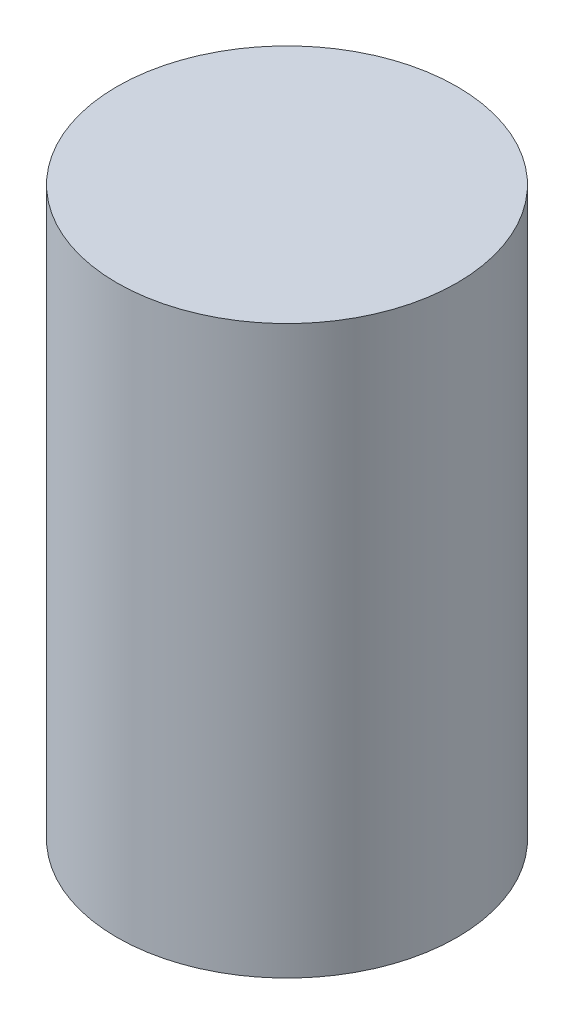
ISO-10303-21;
HEADER;
FILE_DESCRIPTION(('STEP AP214'),'2;1');
FILE_NAME('part.step','',(''),(''),'','','');
FILE_SCHEMA(('AUTOMOTIVE_DESIGN { 1 0 10303 214 1 1 1 1 }'));
ENDSEC;
DATA;
#1=APPLICATION_CONTEXT('core data for automotive mechanical design processes');
#2=APPLICATION_PROTOCOL_DEFINITION('international standard','automotive_design',2000,#1);
#3=PRODUCT_CONTEXT('',#1,'mechanical');
#4=PRODUCT('Part','Part','',(#3));
#5=PRODUCT_RELATED_PRODUCT_CATEGORY('part','',(#4));
#6=PRODUCT_DEFINITION_FORMATION('','',#4);
#7=PRODUCT_DEFINITION_CONTEXT('part definition',#1,'design');
#8=PRODUCT_DEFINITION('design','',#6,#7);
#9=PRODUCT_DEFINITION_SHAPE('','',#8);
#10=(LENGTH_UNIT() NAMED_UNIT(*) SI_UNIT(.MILLI.,.METRE.));
#11=(NAMED_UNIT(*) PLANE_ANGLE_UNIT() SI_UNIT($,.RADIAN.));
#12=(NAMED_UNIT(*) SI_UNIT($,.STERADIAN.) SOLID_ANGLE_UNIT());
#13=UNCERTAINTY_MEASURE_WITH_UNIT(LENGTH_MEASURE(1.E-05),#10,'distance_accuracy_value','');
#14=(GEOMETRIC_REPRESENTATION_CONTEXT(3) GLOBAL_UNCERTAINTY_ASSIGNED_CONTEXT((#13)) GLOBAL_UNIT_ASSIGNED_CONTEXT((#10,
#11,#12)) REPRESENTATION_CONTEXT('',''));
#15=CARTESIAN_POINT('',(0.,0.,0.));
#16=DIRECTION('',(0.,0.,1.));
#17=DIRECTION('',(1.,0.,0.));
#18=AXIS2_PLACEMENT_3D('',#15,#16,#17);
#19=CARTESIAN_POINT('',(0.,100.,0.));
#20=DIRECTION('',(0.,-1.,0.));
#21=DIRECTION('',(0.,0.,-1.));
#22=AXIS2_PLACEMENT_3D('',#19,#20,#21);
#23=CYLINDRICAL_SURFACE('',#22,30.);
#24=CARTESIAN_POINT('',(0.,100.,0.));
#25=DIRECTION('',(0.,1.,0.));
#26=DIRECTION('',(0.,0.,1.));
#27=AXIS2_PLACEMENT_3D('',#24,#25,#26);
#28=CIRCLE('',#27,30.);
#29=CARTESIAN_POINT('',(0.,100.,30.));
#30=VERTEX_POINT('',#29);
#31=EDGE_CURVE('E10',#30,#30,#28,.T.);
#32=ORIENTED_EDGE('',*,*,#31,.F.);
#33=EDGE_LOOP('',(#32));
#34=FACE_BOUND('',#33,.T.);
#35=CARTESIAN_POINT('',(0.,0.,0.));
#36=DIRECTION('',(0.,1.,0.));
#37=DIRECTION('',(0.,0.,1.));
#38=AXIS2_PLACEMENT_3D('',#35,#36,#37);
#39=CIRCLE('',#38,30.);
#40=CARTESIAN_POINT('',(0.,0.,30.));
#41=VERTEX_POINT('',#40);
#42=EDGE_CURVE('E34',#41,#41,#39,.T.);
#43=ORIENTED_EDGE('',*,*,#42,.T.);
#44=EDGE_LOOP('',(#43));
#45=FACE_BOUND('',#44,.T.);
#46=ADVANCED_FACE('F31',(#34,#45),#23,.T.);
#47=CARTESIAN_POINT('',(0.,100.,0.));
#48=DIRECTION('',(0.,1.,0.));
#49=DIRECTION('',(0.,0.,1.));
#50=AXIS2_PLACEMENT_3D('',#47,#48,#49);
#51=PLANE('',#50);
#52=ORIENTED_EDGE('',*,*,#31,.T.);
#53=EDGE_LOOP('',(#52));
#54=FACE_BOUND('',#53,.T.);
#55=ADVANCED_FACE('F46',(#54),#51,.T.);
#56=CARTESIAN_POINT('',(0.,0.,0.));
#57=DIRECTION('',(0.,1.,0.));
#58=DIRECTION('',(0.,0.,1.));
#59=AXIS2_PLACEMENT_3D('',#56,#57,#58);
#60=PLANE('',#59);
#61=ORIENTED_EDGE('',*,*,#42,.F.);
#62=EDGE_LOOP('',(#61));
#63=FACE_BOUND('',#62,.T.);
#64=ADVANCED_FACE('F44',(#63),#60,.F.);
#65=CLOSED_SHELL('',(#46,#55,#64));
#66=MANIFOLD_SOLID_BREP('B2',#65);
#67=ADVANCED_BREP_SHAPE_REPRESENTATION('',(#18,#66),#14);
#68=SHAPE_DEFINITION_REPRESENTATION(#9,#67);
ENDSEC;
END-ISO-10303-21;
